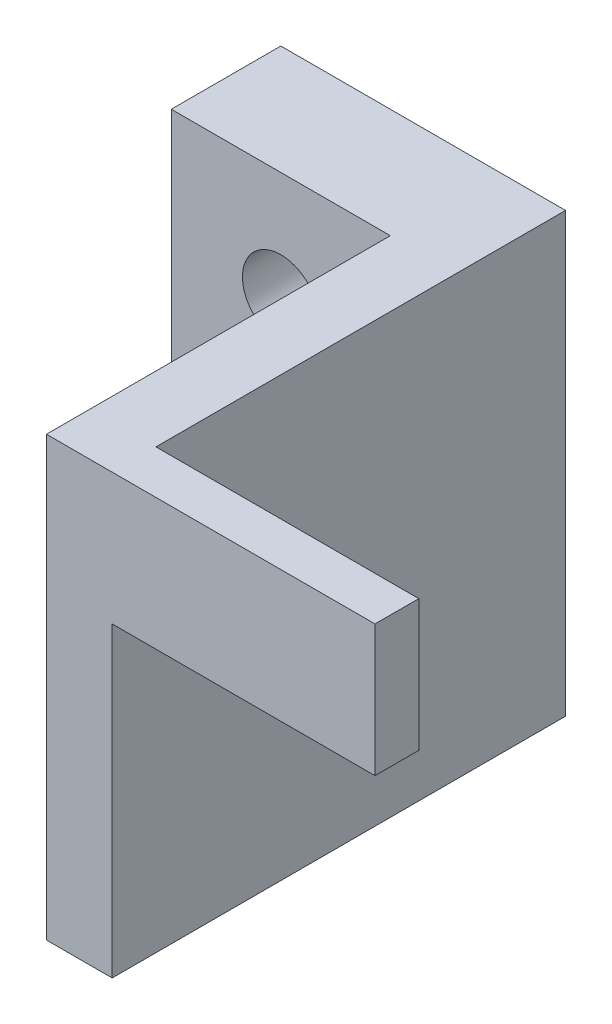
ISO-10303-21;
HEADER;
FILE_DESCRIPTION(('STEP AP214'),'2;1');
FILE_NAME('part.step','',(''),(''),'','','');
FILE_SCHEMA(('AUTOMOTIVE_DESIGN { 1 0 10303 214 1 1 1 1 }'));
ENDSEC;
DATA;
#1=APPLICATION_CONTEXT('core data for automotive mechanical design processes');
#2=APPLICATION_PROTOCOL_DEFINITION('international standard','automotive_design',2000,#1);
#3=PRODUCT_CONTEXT('',#1,'mechanical');
#4=PRODUCT('Part','Part','',(#3));
#5=PRODUCT_RELATED_PRODUCT_CATEGORY('part','',(#4));
#6=PRODUCT_DEFINITION_FORMATION('','',#4);
#7=PRODUCT_DEFINITION_CONTEXT('part definition',#1,'design');
#8=PRODUCT_DEFINITION('design','',#6,#7);
#9=PRODUCT_DEFINITION_SHAPE('','',#8);
#10=(LENGTH_UNIT() NAMED_UNIT(*) SI_UNIT(.MILLI.,.METRE.));
#11=(NAMED_UNIT(*) PLANE_ANGLE_UNIT() SI_UNIT($,.RADIAN.));
#12=(NAMED_UNIT(*) SI_UNIT($,.STERADIAN.) SOLID_ANGLE_UNIT());
#13=UNCERTAINTY_MEASURE_WITH_UNIT(LENGTH_MEASURE(1.E-05),#10,'distance_accuracy_value','');
#14=(GEOMETRIC_REPRESENTATION_CONTEXT(3) GLOBAL_UNCERTAINTY_ASSIGNED_CONTEXT((#13)) GLOBAL_UNIT_ASSIGNED_CONTEXT((#10,
#11,#12)) REPRESENTATION_CONTEXT('',''));
#15=CARTESIAN_POINT('',(0.,0.,0.));
#16=DIRECTION('',(0.,0.,1.));
#17=DIRECTION('',(1.,0.,0.));
#18=AXIS2_PLACEMENT_3D('',#15,#16,#17);
#19=CARTESIAN_POINT('',(0.,0.,5.));
#20=DIRECTION('',(0.,0.,-1.));
#21=DIRECTION('',(-1.,0.,0.));
#22=AXIS2_PLACEMENT_3D('',#19,#20,#21);
#23=PLANE('',#22);
#24=CARTESIAN_POINT('',(5.,5.,5.));
#25=DIRECTION('',(0.,0.,1.));
#26=DIRECTION('',(-1.,0.,0.));
#27=AXIS2_PLACEMENT_3D('',#24,#25,#26);
#28=CIRCLE('',#27,1.75);
#29=CARTESIAN_POINT('',(3.25,5.,5.));
#30=VERTEX_POINT('',#29);
#31=EDGE_CURVE('E206',#30,#30,#28,.T.);
#32=ORIENTED_EDGE('',*,*,#31,.F.);
#33=EDGE_LOOP('',(#32));
#34=FACE_BOUND('',#33,.T.);
#35=CARTESIAN_POINT('',(5.,15.,5.));
#36=DIRECTION('',(0.,0.,1.));
#37=DIRECTION('',(1.,0.,0.));
#38=AXIS2_PLACEMENT_3D('',#35,#36,#37);
#39=CIRCLE('',#38,1.75);
#40=CARTESIAN_POINT('',(6.75,15.,5.));
#41=VERTEX_POINT('',#40);
#42=EDGE_CURVE('E200',#41,#41,#39,.T.);
#43=ORIENTED_EDGE('',*,*,#42,.F.);
#44=EDGE_LOOP('',(#43));
#45=FACE_BOUND('',#44,.T.);
#46=DIRECTION('',(0.,-1.,0.));
#47=VECTOR('',#46,1.);
#48=CARTESIAN_POINT('',(9.99999999999999,20.,5.));
#49=LINE('',#48,#47);
#50=CARTESIAN_POINT('',(9.99999999999999,20.,5.));
#51=VERTEX_POINT('',#50);
#52=CARTESIAN_POINT('',(10.,0.,5.));
#53=VERTEX_POINT('',#52);
#54=EDGE_CURVE('E136',#51,#53,#49,.T.);
#55=ORIENTED_EDGE('',*,*,#54,.F.);
#56=DIRECTION('',(-1.,0.,0.));
#57=VECTOR('',#56,1.);
#58=CARTESIAN_POINT('',(0.,20.,5.));
#59=LINE('',#58,#57);
#60=CARTESIAN_POINT('',(0.,20.,5.));
#61=VERTEX_POINT('',#60);
#62=EDGE_CURVE('E157',#51,#61,#59,.T.);
#63=ORIENTED_EDGE('',*,*,#62,.T.);
#64=DIRECTION('',(0.,-1.,0.));
#65=VECTOR('',#64,1.);
#66=CARTESIAN_POINT('',(0.,0.,5.));
#67=LINE('',#66,#65);
#68=CARTESIAN_POINT('',(0.,0.,5.));
#69=VERTEX_POINT('',#68);
#70=EDGE_CURVE('E150',#61,#69,#67,.T.);
#71=ORIENTED_EDGE('',*,*,#70,.T.);
#72=DIRECTION('',(1.,0.,0.));
#73=VECTOR('',#72,1.);
#74=CARTESIAN_POINT('',(0.,0.,5.));
#75=LINE('',#74,#73);
#76=EDGE_CURVE('E153',#69,#53,#75,.T.);
#77=ORIENTED_EDGE('',*,*,#76,.T.);
#78=EDGE_LOOP('',(#55,#63,#71,#77));
#79=FACE_BOUND('',#78,.T.);
#80=ADVANCED_FACE('F35',(#34,#45,#79),#23,.F.);
#81=CARTESIAN_POINT('',(0.,0.,5.));
#82=DIRECTION('',(1.,0.,0.));
#83=DIRECTION('',(0.,1.,0.));
#84=AXIS2_PLACEMENT_3D('',#81,#82,#83);
#85=PLANE('',#84);
#86=DIRECTION('',(0.,-1.,0.));
#87=VECTOR('',#86,1.);
#88=CARTESIAN_POINT('',(0.,0.,0.));
#89=LINE('',#88,#87);
#90=CARTESIAN_POINT('',(0.,20.,0.));
#91=VERTEX_POINT('',#90);
#92=CARTESIAN_POINT('',(0.,0.,0.));
#93=VERTEX_POINT('',#92);
#94=EDGE_CURVE('E149',#91,#93,#89,.T.);
#95=ORIENTED_EDGE('',*,*,#94,.T.);
#96=DIRECTION('',(0.,0.,-1.));
#97=VECTOR('',#96,1.);
#98=CARTESIAN_POINT('',(0.,0.,5.));
#99=LINE('',#98,#97);
#100=EDGE_CURVE('E43',#69,#93,#99,.T.);
#101=ORIENTED_EDGE('',*,*,#100,.F.);
#102=ORIENTED_EDGE('',*,*,#70,.F.);
#103=DIRECTION('',(0.,0.,-1.));
#104=VECTOR('',#103,1.);
#105=CARTESIAN_POINT('',(0.,20.,5.));
#106=LINE('',#105,#104);
#107=EDGE_CURVE('E159',#61,#91,#106,.T.);
#108=ORIENTED_EDGE('',*,*,#107,.T.);
#109=EDGE_LOOP('',(#95,#101,#102,#108));
#110=FACE_BOUND('',#109,.T.);
#111=ADVANCED_FACE('F37',(#110),#85,.F.);
#112=CARTESIAN_POINT('',(0.,0.,5.));
#113=DIRECTION('',(0.,1.,0.));
#114=DIRECTION('',(0.,0.,1.));
#115=AXIS2_PLACEMENT_3D('',#112,#113,#114);
#116=PLANE('',#115);
#117=DIRECTION('',(0.,0.,-1.));
#118=VECTOR('',#117,1.);
#119=CARTESIAN_POINT('',(13.,0.,5.));
#120=LINE('',#119,#118);
#121=CARTESIAN_POINT('',(13.,0.,20.7));
#122=VERTEX_POINT('',#121);
#123=CARTESIAN_POINT('',(13.,0.,0.));
#124=VERTEX_POINT('',#123);
#125=EDGE_CURVE('E172',#122,#124,#120,.T.);
#126=ORIENTED_EDGE('',*,*,#125,.F.);
#127=DIRECTION('',(1.,0.,0.));
#128=VECTOR('',#127,1.);
#129=CARTESIAN_POINT('',(13.,0.,20.7));
#130=LINE('',#129,#128);
#131=CARTESIAN_POINT('',(10.,0.,20.7));
#132=VERTEX_POINT('',#131);
#133=EDGE_CURVE('E141',#132,#122,#130,.T.);
#134=ORIENTED_EDGE('',*,*,#133,.F.);
#135=DIRECTION('',(0.,0.,-1.));
#136=VECTOR('',#135,1.);
#137=CARTESIAN_POINT('',(10.,0.,20.7));
#138=LINE('',#137,#136);
#139=EDGE_CURVE('E143',#132,#53,#138,.T.);
#140=ORIENTED_EDGE('',*,*,#139,.T.);
#141=ORIENTED_EDGE('',*,*,#76,.F.);
#142=ORIENTED_EDGE('',*,*,#100,.T.);
#143=DIRECTION('',(1.,0.,0.));
#144=VECTOR('',#143,1.);
#145=CARTESIAN_POINT('',(0.,0.,0.));
#146=LINE('',#145,#144);
#147=EDGE_CURVE('E162',#93,#124,#146,.T.);
#148=ORIENTED_EDGE('',*,*,#147,.T.);
#149=EDGE_LOOP('',(#126,#134,#140,#141,#142,#148));
#150=FACE_BOUND('',#149,.T.);
#151=ADVANCED_FACE('F176',(#150),#116,.F.);
#152=CARTESIAN_POINT('',(13.,0.,5.));
#153=DIRECTION('',(-1.,0.,0.));
#154=DIRECTION('',(0.,-1.,0.));
#155=AXIS2_PLACEMENT_3D('',#152,#153,#154);
#156=PLANE('',#155);
#157=DIRECTION('',(0.,-1.,0.));
#158=VECTOR('',#157,1.);
#159=CARTESIAN_POINT('',(13.,0.,18.7));
#160=LINE('',#159,#158);
#161=CARTESIAN_POINT('',(13.,20.,18.7));
#162=VERTEX_POINT('',#161);
#163=CARTESIAN_POINT('',(13.,14.,18.7));
#164=VERTEX_POINT('',#163);
#165=EDGE_CURVE('E133',#162,#164,#160,.T.);
#166=ORIENTED_EDGE('',*,*,#165,.T.);
#167=DIRECTION('',(0.,0.,1.));
#168=VECTOR('',#167,1.);
#169=CARTESIAN_POINT('',(13.,14.,0.));
#170=LINE('',#169,#168);
#171=CARTESIAN_POINT('',(13.,14.,20.7));
#172=VERTEX_POINT('',#171);
#173=EDGE_CURVE('E127',#164,#172,#170,.T.);
#174=ORIENTED_EDGE('',*,*,#173,.T.);
#175=DIRECTION('',(0.,-1.,0.));
#176=VECTOR('',#175,1.);
#177=CARTESIAN_POINT('',(13.,0.,20.7));
#178=LINE('',#177,#176);
#179=EDGE_CURVE('E118',#172,#122,#178,.T.);
#180=ORIENTED_EDGE('',*,*,#179,.T.);
#181=ORIENTED_EDGE('',*,*,#125,.T.);
#182=DIRECTION('',(0.,1.,0.));
#183=VECTOR('',#182,1.);
#184=CARTESIAN_POINT('',(13.,0.,0.));
#185=LINE('',#184,#183);
#186=CARTESIAN_POINT('',(13.,20.,0.));
#187=VERTEX_POINT('',#186);
#188=EDGE_CURVE('E165',#124,#187,#185,.T.);
#189=ORIENTED_EDGE('',*,*,#188,.T.);
#190=DIRECTION('',(0.,0.,-1.));
#191=VECTOR('',#190,1.);
#192=CARTESIAN_POINT('',(13.,20.,5.));
#193=LINE('',#192,#191);
#194=EDGE_CURVE('E170',#162,#187,#193,.T.);
#195=ORIENTED_EDGE('',*,*,#194,.F.);
#196=EDGE_LOOP('',(#166,#174,#180,#181,#189,#195));
#197=FACE_BOUND('',#196,.T.);
#198=ADVANCED_FACE('F187',(#197),#156,.F.);
#199=CARTESIAN_POINT('',(0.,20.,5.));
#200=DIRECTION('',(0.,-1.,0.));
#201=DIRECTION('',(0.,0.,-1.));
#202=AXIS2_PLACEMENT_3D('',#199,#200,#201);
#203=PLANE('',#202);
#204=ORIENTED_EDGE('',*,*,#62,.F.);
#205=DIRECTION('',(0.,0.,-1.));
#206=VECTOR('',#205,1.);
#207=CARTESIAN_POINT('',(9.99999999999999,20.,20.7));
#208=LINE('',#207,#206);
#209=CARTESIAN_POINT('',(9.99999999999999,20.,20.7));
#210=VERTEX_POINT('',#209);
#211=EDGE_CURVE('E147',#210,#51,#208,.T.);
#212=ORIENTED_EDGE('',*,*,#211,.F.);
#213=DIRECTION('',(-1.,0.,0.));
#214=VECTOR('',#213,1.);
#215=CARTESIAN_POINT('',(13.,20.,20.7));
#216=LINE('',#215,#214);
#217=CARTESIAN_POINT('',(25.,20.,20.7));
#218=VERTEX_POINT('',#217);
#219=EDGE_CURVE('E137',#218,#210,#216,.T.);
#220=ORIENTED_EDGE('',*,*,#219,.F.);
#221=DIRECTION('',(0.,0.,-1.));
#222=VECTOR('',#221,1.);
#223=CARTESIAN_POINT('',(25.,20.,20.7));
#224=LINE('',#223,#222);
#225=CARTESIAN_POINT('',(25.,20.,18.7));
#226=VERTEX_POINT('',#225);
#227=EDGE_CURVE('E123',#218,#226,#224,.T.);
#228=ORIENTED_EDGE('',*,*,#227,.T.);
#229=DIRECTION('',(-1.,0.,0.));
#230=VECTOR('',#229,1.);
#231=CARTESIAN_POINT('',(25.,20.,18.7));
#232=LINE('',#231,#230);
#233=EDGE_CURVE('E57',#226,#162,#232,.T.);
#234=ORIENTED_EDGE('',*,*,#233,.T.);
#235=ORIENTED_EDGE('',*,*,#194,.T.);
#236=DIRECTION('',(-1.,0.,0.));
#237=VECTOR('',#236,1.);
#238=CARTESIAN_POINT('',(0.,20.,0.));
#239=LINE('',#238,#237);
#240=EDGE_CURVE('E154',#187,#91,#239,.T.);
#241=ORIENTED_EDGE('',*,*,#240,.T.);
#242=ORIENTED_EDGE('',*,*,#107,.F.);
#243=EDGE_LOOP('',(#204,#212,#220,#228,#234,#235,#241,#242));
#244=FACE_BOUND('',#243,.T.);
#245=ADVANCED_FACE('F189',(#244),#203,.F.);
#246=CARTESIAN_POINT('',(0.,0.,0.));
#247=DIRECTION('',(0.,0.,-1.));
#248=DIRECTION('',(-1.,0.,0.));
#249=AXIS2_PLACEMENT_3D('',#246,#247,#248);
#250=PLANE('',#249);
#251=CARTESIAN_POINT('',(5.,5.,0.));
#252=DIRECTION('',(0.,0.,1.));
#253=DIRECTION('',(-1.,0.,0.));
#254=AXIS2_PLACEMENT_3D('',#251,#252,#253);
#255=CIRCLE('',#254,1.75);
#256=CARTESIAN_POINT('',(3.25,5.,0.));
#257=VERTEX_POINT('',#256);
#258=EDGE_CURVE('E203',#257,#257,#255,.T.);
#259=ORIENTED_EDGE('',*,*,#258,.T.);
#260=EDGE_LOOP('',(#259));
#261=FACE_BOUND('',#260,.T.);
#262=CARTESIAN_POINT('',(5.,15.,0.));
#263=DIRECTION('',(0.,0.,1.));
#264=DIRECTION('',(1.,0.,0.));
#265=AXIS2_PLACEMENT_3D('',#262,#263,#264);
#266=CIRCLE('',#265,1.75);
#267=CARTESIAN_POINT('',(6.75,15.,0.));
#268=VERTEX_POINT('',#267);
#269=EDGE_CURVE('E119',#268,#268,#266,.T.);
#270=ORIENTED_EDGE('',*,*,#269,.T.);
#271=EDGE_LOOP('',(#270));
#272=FACE_BOUND('',#271,.T.);
#273=ORIENTED_EDGE('',*,*,#94,.F.);
#274=ORIENTED_EDGE('',*,*,#240,.F.);
#275=ORIENTED_EDGE('',*,*,#188,.F.);
#276=ORIENTED_EDGE('',*,*,#147,.F.);
#277=EDGE_LOOP('',(#273,#274,#275,#276));
#278=FACE_BOUND('',#277,.T.);
#279=ADVANCED_FACE('F184',(#261,#272,#278),#250,.T.);
#280=CARTESIAN_POINT('',(9.99999999999999,20.,20.7));
#281=DIRECTION('',(1.,0.,0.));
#282=DIRECTION('',(0.,1.,0.));
#283=AXIS2_PLACEMENT_3D('',#280,#281,#282);
#284=PLANE('',#283);
#285=ORIENTED_EDGE('',*,*,#54,.T.);
#286=ORIENTED_EDGE('',*,*,#139,.F.);
#287=DIRECTION('',(0.,-1.,0.));
#288=VECTOR('',#287,1.);
#289=CARTESIAN_POINT('',(9.99999999999999,20.,20.7));
#290=LINE('',#289,#288);
#291=EDGE_CURVE('E139',#210,#132,#290,.T.);
#292=ORIENTED_EDGE('',*,*,#291,.F.);
#293=ORIENTED_EDGE('',*,*,#211,.T.);
#294=EDGE_LOOP('',(#285,#286,#292,#293));
#295=FACE_BOUND('',#294,.T.);
#296=ADVANCED_FACE('F195',(#295),#284,.F.);
#297=CARTESIAN_POINT('',(0.,0.,20.7));
#298=DIRECTION('',(0.,0.,-1.));
#299=DIRECTION('',(-1.,0.,0.));
#300=AXIS2_PLACEMENT_3D('',#297,#298,#299);
#301=PLANE('',#300);
#302=ORIENTED_EDGE('',*,*,#133,.T.);
#303=ORIENTED_EDGE('',*,*,#179,.F.);
#304=DIRECTION('',(-1.,0.,0.));
#305=VECTOR('',#304,1.);
#306=CARTESIAN_POINT('',(25.,14.,20.7));
#307=LINE('',#306,#305);
#308=CARTESIAN_POINT('',(25.,14.,20.7));
#309=VERTEX_POINT('',#308);
#310=EDGE_CURVE('E106',#309,#172,#307,.T.);
#311=ORIENTED_EDGE('',*,*,#310,.F.);
#312=DIRECTION('',(0.,1.,0.));
#313=VECTOR('',#312,1.);
#314=CARTESIAN_POINT('',(25.,20.,20.7));
#315=LINE('',#314,#313);
#316=EDGE_CURVE('E115',#309,#218,#315,.T.);
#317=ORIENTED_EDGE('',*,*,#316,.T.);
#318=ORIENTED_EDGE('',*,*,#219,.T.);
#319=ORIENTED_EDGE('',*,*,#291,.T.);
#320=EDGE_LOOP('',(#302,#303,#311,#317,#318,#319));
#321=FACE_BOUND('',#320,.T.);
#322=ADVANCED_FACE('F114',(#321),#301,.F.);
#323=CARTESIAN_POINT('',(25.,20.,18.7));
#324=DIRECTION('',(0.,0.,-1.));
#325=DIRECTION('',(0.,1.,0.));
#326=AXIS2_PLACEMENT_3D('',#323,#324,#325);
#327=PLANE('',#326);
#328=DIRECTION('',(1.,0.,0.));
#329=VECTOR('',#328,1.);
#330=CARTESIAN_POINT('',(25.,14.,18.7));
#331=LINE('',#330,#329);
#332=CARTESIAN_POINT('',(25.,14.,18.7));
#333=VERTEX_POINT('',#332);
#334=EDGE_CURVE('E49',#164,#333,#331,.T.);
#335=ORIENTED_EDGE('',*,*,#334,.F.);
#336=ORIENTED_EDGE('',*,*,#165,.F.);
#337=ORIENTED_EDGE('',*,*,#233,.F.);
#338=DIRECTION('',(0.,-1.,0.));
#339=VECTOR('',#338,1.);
#340=CARTESIAN_POINT('',(25.,20.,18.7));
#341=LINE('',#340,#339);
#342=EDGE_CURVE('E125',#226,#333,#341,.T.);
#343=ORIENTED_EDGE('',*,*,#342,.T.);
#344=EDGE_LOOP('',(#335,#336,#337,#343));
#345=FACE_BOUND('',#344,.T.);
#346=ADVANCED_FACE('F237',(#345),#327,.T.);
#347=CARTESIAN_POINT('',(25.,0.,0.));
#348=DIRECTION('',(1.,0.,0.));
#349=DIRECTION('',(0.,1.,0.));
#350=AXIS2_PLACEMENT_3D('',#347,#348,#349);
#351=PLANE('',#350);
#352=DIRECTION('',(0.,0.,1.));
#353=VECTOR('',#352,1.);
#354=CARTESIAN_POINT('',(25.,14.,0.));
#355=LINE('',#354,#353);
#356=EDGE_CURVE('E11',#333,#309,#355,.T.);
#357=ORIENTED_EDGE('',*,*,#356,.F.);
#358=ORIENTED_EDGE('',*,*,#342,.F.);
#359=ORIENTED_EDGE('',*,*,#227,.F.);
#360=ORIENTED_EDGE('',*,*,#316,.F.);
#361=EDGE_LOOP('',(#357,#358,#359,#360));
#362=FACE_BOUND('',#361,.T.);
#363=ADVANCED_FACE('F122',(#362),#351,.T.);
#364=CARTESIAN_POINT('',(25.,14.,0.));
#365=DIRECTION('',(0.,1.,0.));
#366=DIRECTION('',(-1.,0.,0.));
#367=AXIS2_PLACEMENT_3D('',#364,#365,#366);
#368=PLANE('',#367);
#369=ORIENTED_EDGE('',*,*,#334,.T.);
#370=ORIENTED_EDGE('',*,*,#356,.T.);
#371=ORIENTED_EDGE('',*,*,#310,.T.);
#372=ORIENTED_EDGE('',*,*,#173,.F.);
#373=EDGE_LOOP('',(#369,#370,#371,#372));
#374=FACE_BOUND('',#373,.T.);
#375=ADVANCED_FACE('F105',(#374),#368,.F.);
#376=CARTESIAN_POINT('',(5.,15.,0.));
#377=DIRECTION('',(0.,0.,1.));
#378=DIRECTION('',(1.,0.,0.));
#379=AXIS2_PLACEMENT_3D('',#376,#377,#378);
#380=CYLINDRICAL_SURFACE('',#379,1.75);
#381=ORIENTED_EDGE('',*,*,#269,.F.);
#382=EDGE_LOOP('',(#381));
#383=FACE_BOUND('',#382,.T.);
#384=ORIENTED_EDGE('',*,*,#42,.T.);
#385=EDGE_LOOP('',(#384));
#386=FACE_BOUND('',#385,.T.);
#387=ADVANCED_FACE('F217',(#383,#386),#380,.F.);
#388=CARTESIAN_POINT('',(5.,5.,0.));
#389=DIRECTION('',(0.,0.,1.));
#390=DIRECTION('',(1.,0.,0.));
#391=AXIS2_PLACEMENT_3D('',#388,#389,#390);
#392=CYLINDRICAL_SURFACE('',#391,1.75);
#393=ORIENTED_EDGE('',*,*,#258,.F.);
#394=EDGE_LOOP('',(#393));
#395=FACE_BOUND('',#394,.T.);
#396=ORIENTED_EDGE('',*,*,#31,.T.);
#397=EDGE_LOOP('',(#396));
#398=FACE_BOUND('',#397,.T.);
#399=ADVANCED_FACE('F214',(#395,#398),#392,.F.);
#400=CLOSED_SHELL('',(#80,#111,#151,#198,#245,#279,#296,#322,#346,#363,#375,#387,#399));
#401=MANIFOLD_SOLID_BREP('B2',#400);
#402=ADVANCED_BREP_SHAPE_REPRESENTATION('',(#18,#401),#14);
#403=SHAPE_DEFINITION_REPRESENTATION(#9,#402);
ENDSEC;
END-ISO-10303-21;
